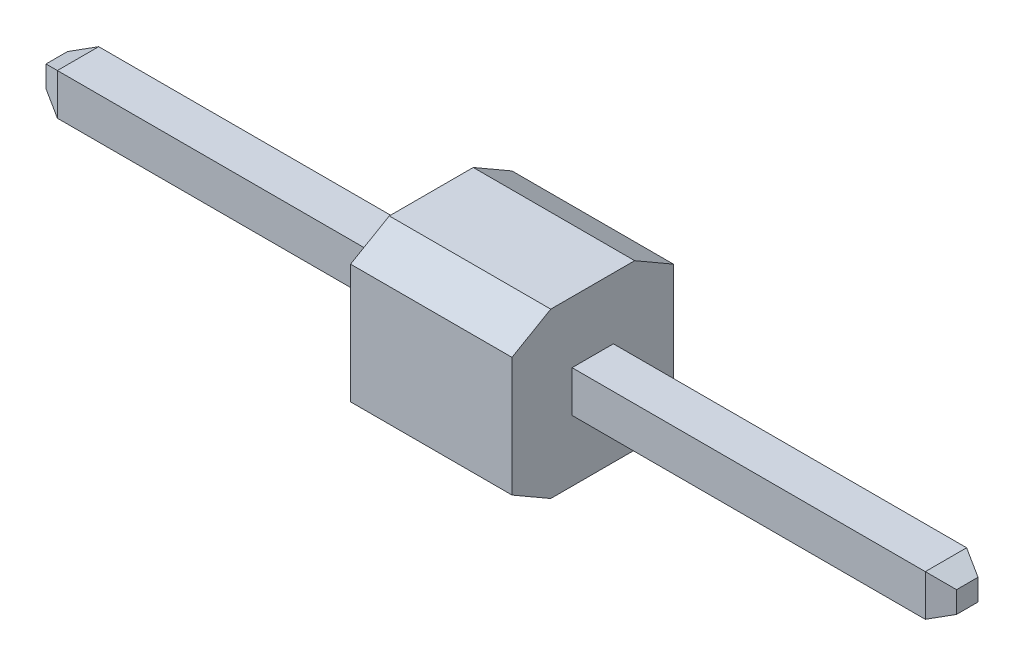
ISO-10303-21;
HEADER;
FILE_DESCRIPTION(('STEP AP214'),'2;1');
FILE_NAME('part.step','',(''),(''),'','','');
FILE_SCHEMA(('AUTOMOTIVE_DESIGN { 1 0 10303 214 1 1 1 1 }'));
ENDSEC;
DATA;
#1=APPLICATION_CONTEXT('core data for automotive mechanical design processes');
#2=APPLICATION_PROTOCOL_DEFINITION('international standard','automotive_design',2000,#1);
#3=PRODUCT_CONTEXT('',#1,'mechanical');
#4=PRODUCT('Part','Part','',(#3));
#5=PRODUCT_RELATED_PRODUCT_CATEGORY('part','',(#4));
#6=PRODUCT_DEFINITION_FORMATION('','',#4);
#7=PRODUCT_DEFINITION_CONTEXT('part definition',#1,'design');
#8=PRODUCT_DEFINITION('design','',#6,#7);
#9=PRODUCT_DEFINITION_SHAPE('','',#8);
#10=(LENGTH_UNIT() NAMED_UNIT(*) SI_UNIT(.MILLI.,.METRE.));
#11=(NAMED_UNIT(*) PLANE_ANGLE_UNIT() SI_UNIT($,.RADIAN.));
#12=(NAMED_UNIT(*) SI_UNIT($,.STERADIAN.) SOLID_ANGLE_UNIT());
#13=UNCERTAINTY_MEASURE_WITH_UNIT(LENGTH_MEASURE(1.E-05),#10,'distance_accuracy_value','');
#14=(GEOMETRIC_REPRESENTATION_CONTEXT(3) GLOBAL_UNCERTAINTY_ASSIGNED_CONTEXT((#13)) GLOBAL_UNIT_ASSIGNED_CONTEXT((#10,
#11,#12)) REPRESENTATION_CONTEXT('',''));
#15=CARTESIAN_POINT('',(0.,0.,0.));
#16=DIRECTION('',(0.,0.,1.));
#17=DIRECTION('',(1.,0.,0.));
#18=AXIS2_PLACEMENT_3D('',#15,#16,#17);
#19=CARTESIAN_POINT('',(5.42107539978359,-2.22288427394286,-2.77112037351091));
#20=DIRECTION('',(1.,-9.93476518829084E-08,4.37113882867379E-08));
#21=DIRECTION('',(-9.93476589883358E-08,-1.,8.74227765734759E-08));
#22=AXIS2_PLACEMENT_3D('',#19,#20,#21);
#23=PLANE('',#22);
#24=DIRECTION('',(-1.18186619959243E-08,-0.50000007571054,-0.866025360072933));
#25=VECTOR('',#24,1.);
#26=CARTESIAN_POINT('',(5.42107520760898,-3.46647397517509,-1.20112026479284));
#27=LINE('',#26,#25);
#28=CARTESIAN_POINT('',(5.42107520760898,-3.46647397517509,-1.20112026479284));
#29=VERTEX_POINT('',#28);
#30=CARTESIAN_POINT('',(5.42107519942078,-3.81288418914276,-1.8011202345087));
#31=VERTEX_POINT('',#30);
#32=EDGE_CURVE('E11',#29,#31,#27,.T.);
#33=ORIENTED_EDGE('',*,*,#32,.T.);
#34=DIRECTION('',(4.37113811813104E-08,-8.74227828590458E-08,-0.999999999999995));
#35=VECTOR('',#34,1.);
#36=CARTESIAN_POINT('',(5.42107519942078,-3.81288418914276,-1.8011202345087));
#37=LINE('',#36,#35);
#38=CARTESIAN_POINT('',(5.42107525624557,-3.81288430279238,-3.1011202345087));
#39=VERTEX_POINT('',#38);
#40=EDGE_CURVE('E304',#31,#39,#37,.T.);
#41=ORIENTED_EDGE('',*,*,#40,.T.);
#42=DIRECTION('',(8.75289950709518E-08,0.499999924289835,-0.866025447495714));
#43=VECTOR('',#42,1.);
#44=CARTESIAN_POINT('',(5.42107525624557,-3.81288430279238,-3.1011202345087));
#45=LINE('',#44,#43);
#46=CARTESIAN_POINT('',(5.42107531688744,-3.46647419373205,-3.70112026479284));
#47=VERTEX_POINT('',#46);
#48=EDGE_CURVE('E296',#39,#47,#45,.T.);
#49=ORIENTED_EDGE('',*,*,#48,.T.);
#50=DIRECTION('',(9.93476593246923E-08,0.999999999999991,-8.7422776482468E-08));
#51=VECTOR('',#50,1.);
#52=CARTESIAN_POINT('',(5.42107531688744,-3.46647419373205,-3.70112026479284));
#53=LINE('',#52,#51);
#54=CARTESIAN_POINT('',(5.42107550040041,-1.61929451676605,-3.70112042627841));
#55=VERTEX_POINT('',#54);
#56=EDGE_CURVE('E281',#47,#55,#53,.T.);
#57=ORIENTED_EDGE('',*,*,#56,.T.);
#58=DIRECTION('',(-1.18186619958731E-08,-0.500000075710537,-0.866025360072935));
#59=VECTOR('',#58,1.);
#60=CARTESIAN_POINT('',(5.42107550858862,-1.27288430279238,-3.10112045656255));
#61=LINE('',#60,#59);
#62=CARTESIAN_POINT('',(5.42107550858862,-1.27288430279238,-3.10112045656255));
#63=VERTEX_POINT('',#62);
#64=EDGE_CURVE('E265',#63,#55,#61,.T.);
#65=ORIENTED_EDGE('',*,*,#64,.F.);
#66=DIRECTION('',(4.37113811813104E-08,-8.74227828590458E-08,-0.999999999999995));
#67=VECTOR('',#66,1.);
#68=CARTESIAN_POINT('',(5.42107545176383,-1.27288418914276,-1.80112045656255));
#69=LINE('',#68,#67);
#70=CARTESIAN_POINT('',(5.42107545176383,-1.27288418914276,-1.80112045656255));
#71=VERTEX_POINT('',#70);
#72=EDGE_CURVE('E248',#71,#63,#69,.T.);
#73=ORIENTED_EDGE('',*,*,#72,.F.);
#74=DIRECTION('',(8.75289950705729E-08,0.499999924289834,-0.866025447495714));
#75=VECTOR('',#74,1.);
#76=CARTESIAN_POINT('',(5.42107539112196,-1.61929429820909,-1.20112042627841));
#77=LINE('',#76,#75);
#78=CARTESIAN_POINT('',(5.42107539112196,-1.61929429820909,-1.20112042627841));
#79=VERTEX_POINT('',#78);
#80=EDGE_CURVE('E242',#79,#71,#77,.T.);
#81=ORIENTED_EDGE('',*,*,#80,.F.);
#82=DIRECTION('',(9.93476593246923E-08,0.999999999999991,-8.7422776482468E-08));
#83=VECTOR('',#82,1.);
#84=CARTESIAN_POINT('',(5.42107520760898,-3.46647397517509,-1.20112026479284));
#85=LINE('',#84,#83);
#86=EDGE_CURVE('E236',#29,#79,#85,.T.);
#87=ORIENTED_EDGE('',*,*,#86,.F.);
#88=EDGE_LOOP('',(#33,#41,#49,#57,#65,#73,#81,#87));
#89=FACE_BOUND('',#88,.T.);
#90=DIRECTION('',(-4.37113803486431E-08,8.74227829017466E-08,0.999999999999995));
#91=VECTOR('',#90,1.);
#92=CARTESIAN_POINT('',(5.42107533620109,-2.86288427394286,-2.77112031756034));
#93=LINE('',#92,#91);
#94=CARTESIAN_POINT('',(5.42107533620109,-2.86288427394286,-2.77112031756034));
#95=VERTEX_POINT('',#94);
#96=CARTESIAN_POINT('',(5.42107530822581,-2.86288421799228,-2.13112031756034));
#97=VERTEX_POINT('',#96);
#98=EDGE_CURVE('E302',#95,#97,#93,.T.);
#99=ORIENTED_EDGE('',*,*,#98,.T.);
#100=DIRECTION('',(-9.93476592658906E-08,-0.999999999999991,8.74227766567418E-08));
#101=VECTOR('',#100,1.);
#102=CARTESIAN_POINT('',(5.42107537180831,-2.22288421799228,-2.13112037351091));
#103=LINE('',#102,#101);
#104=CARTESIAN_POINT('',(5.42107537180831,-2.22288421799228,-2.13112037351091));
#105=VERTEX_POINT('',#104);
#106=EDGE_CURVE('E293',#105,#97,#103,.T.);
#107=ORIENTED_EDGE('',*,*,#106,.F.);
#108=DIRECTION('',(-4.37113803486431E-08,8.74227829017466E-08,0.999999999999995));
#109=VECTOR('',#108,1.);
#110=CARTESIAN_POINT('',(5.42107539978359,-2.22288427394286,-2.77112037351091));
#111=LINE('',#110,#109);
#112=CARTESIAN_POINT('',(5.42107539978359,-2.22288427394286,-2.77112037351091));
#113=VERTEX_POINT('',#112);
#114=EDGE_CURVE('E278',#113,#105,#111,.T.);
#115=ORIENTED_EDGE('',*,*,#114,.F.);
#116=DIRECTION('',(-9.93476592658906E-08,-0.999999999999991,8.74227766567418E-08));
#117=VECTOR('',#116,1.);
#118=CARTESIAN_POINT('',(5.42107539978359,-2.22288427394286,-2.77112037351091));
#119=LINE('',#118,#117);
#120=EDGE_CURVE('E263',#113,#95,#119,.T.);
#121=ORIENTED_EDGE('',*,*,#120,.T.);
#122=EDGE_LOOP('',(#99,#107,#115,#121));
#123=FACE_BOUND('',#122,.T.);
#124=ADVANCED_FACE('F17',(#89,#123),#23,.T.);
#125=CARTESIAN_POINT('',(2.92107539978359,-2.22288402557373,-2.77112048278938));
#126=DIRECTION('',(1.,-9.93476518829084E-08,4.37113882867379E-08));
#127=DIRECTION('',(-9.93476589883358E-08,-1.,8.74227765734759E-08));
#128=AXIS2_PLACEMENT_3D('',#125,#126,#127);
#129=PLANE('',#128);
#130=DIRECTION('',(-1.18186632778994E-08,-0.50000007571054,-0.866025360072933));
#131=VECTOR('',#130,1.);
#132=CARTESIAN_POINT('',(2.92107520760898,-3.46647372680596,-1.20112037407131));
#133=LINE('',#132,#131);
#134=CARTESIAN_POINT('',(2.92107520760898,-3.46647372680596,-1.20112037407131));
#135=VERTEX_POINT('',#134);
#136=CARTESIAN_POINT('',(2.92107519942077,-3.81288394077363,-1.80112034378717));
#137=VERTEX_POINT('',#136);
#138=EDGE_CURVE('E24',#135,#137,#133,.T.);
#139=ORIENTED_EDGE('',*,*,#138,.F.);
#140=DIRECTION('',(9.93476588438628E-08,0.999999999999991,-8.7422776482468E-08));
#141=VECTOR('',#140,1.);
#142=CARTESIAN_POINT('',(2.92107520760898,-3.46647372680596,-1.20112037407131));
#143=LINE('',#142,#141);
#144=CARTESIAN_POINT('',(2.92107539112196,-1.61929404983996,-1.20112053555688));
#145=VERTEX_POINT('',#144);
#146=EDGE_CURVE('E300',#135,#145,#143,.T.);
#147=ORIENTED_EDGE('',*,*,#146,.T.);
#148=DIRECTION('',(8.7528996352548E-08,0.499999924289834,-0.866025447495714));
#149=VECTOR('',#148,1.);
#150=CARTESIAN_POINT('',(2.92107539112196,-1.61929404983996,-1.20112053555688));
#151=LINE('',#150,#149);
#152=CARTESIAN_POINT('',(2.92107545176383,-1.27288394077363,-1.80112056584102));
#153=VERTEX_POINT('',#152);
#154=EDGE_CURVE('E286',#145,#153,#151,.T.);
#155=ORIENTED_EDGE('',*,*,#154,.T.);
#156=DIRECTION('',(4.37113811813104E-08,-8.74227828590458E-08,-0.999999999999995));
#157=VECTOR('',#156,1.);
#158=CARTESIAN_POINT('',(2.92107545176383,-1.27288394077363,-1.80112056584102));
#159=LINE('',#158,#157);
#160=CARTESIAN_POINT('',(2.92107550858862,-1.27288405442325,-3.10112056584102));
#161=VERTEX_POINT('',#160);
#162=EDGE_CURVE('E271',#153,#161,#159,.T.);
#163=ORIENTED_EDGE('',*,*,#162,.T.);
#164=DIRECTION('',(-1.18186632778483E-08,-0.500000075710537,-0.866025360072935));
#165=VECTOR('',#164,1.);
#166=CARTESIAN_POINT('',(2.92107550858862,-1.27288405442325,-3.10112056584102));
#167=LINE('',#166,#165);
#168=CARTESIAN_POINT('',(2.92107550040041,-1.61929426839692,-3.70112053555688));
#169=VERTEX_POINT('',#168);
#170=EDGE_CURVE('E253',#161,#169,#167,.T.);
#171=ORIENTED_EDGE('',*,*,#170,.T.);
#172=DIRECTION('',(9.93476588438628E-08,0.999999999999991,-8.7422776482468E-08));
#173=VECTOR('',#172,1.);
#174=CARTESIAN_POINT('',(2.92107531688744,-3.46647394536292,-3.70112037407131));
#175=LINE('',#174,#173);
#176=CARTESIAN_POINT('',(2.92107531688744,-3.46647394536292,-3.70112037407131));
#177=VERTEX_POINT('',#176);
#178=EDGE_CURVE('E261',#177,#169,#175,.T.);
#179=ORIENTED_EDGE('',*,*,#178,.F.);
#180=DIRECTION('',(8.75289963529269E-08,0.499999924289835,-0.866025447495714));
#181=VECTOR('',#180,1.);
#182=CARTESIAN_POINT('',(2.92107525624557,-3.81288405442325,-3.10112034378717));
#183=LINE('',#182,#181);
#184=CARTESIAN_POINT('',(2.92107525624557,-3.81288405442325,-3.10112034378717));
#185=VERTEX_POINT('',#184);
#186=EDGE_CURVE('E276',#185,#177,#183,.T.);
#187=ORIENTED_EDGE('',*,*,#186,.F.);
#188=DIRECTION('',(4.37113811813104E-08,-8.74227828590458E-08,-0.999999999999995));
#189=VECTOR('',#188,1.);
#190=CARTESIAN_POINT('',(2.92107519942077,-3.81288394077363,-1.80112034378717));
#191=LINE('',#190,#189);
#192=EDGE_CURVE('E291',#137,#185,#191,.T.);
#193=ORIENTED_EDGE('',*,*,#192,.F.);
#194=EDGE_LOOP('',(#139,#147,#155,#163,#171,#179,#187,#193));
#195=FACE_BOUND('',#194,.T.);
#196=DIRECTION('',(-9.93476585720012E-08,-0.999999999999991,8.74227766567418E-08));
#197=VECTOR('',#196,1.);
#198=CARTESIAN_POINT('',(2.92107537180831,-2.22288396962315,-2.13112048278938));
#199=LINE('',#198,#197);
#200=CARTESIAN_POINT('',(2.92107537180831,-2.22288396962315,-2.13112048278938));
#201=VERTEX_POINT('',#200);
#202=CARTESIAN_POINT('',(2.92107530822581,-2.86288396962315,-2.13112042683881));
#203=VERTEX_POINT('',#202);
#204=EDGE_CURVE('E298',#201,#203,#199,.T.);
#205=ORIENTED_EDGE('',*,*,#204,.T.);
#206=DIRECTION('',(-4.37113810425325E-08,8.74227829017466E-08,0.999999999999995));
#207=VECTOR('',#206,1.);
#208=CARTESIAN_POINT('',(2.92107533620109,-2.86288402557373,-2.77112042683881));
#209=LINE('',#208,#207);
#210=CARTESIAN_POINT('',(2.92107533620109,-2.86288402557373,-2.77112042683881));
#211=VERTEX_POINT('',#210);
#212=EDGE_CURVE('E283',#211,#203,#209,.T.);
#213=ORIENTED_EDGE('',*,*,#212,.F.);
#214=DIRECTION('',(-9.93476585720012E-08,-0.999999999999991,8.74227766567418E-08));
#215=VECTOR('',#214,1.);
#216=CARTESIAN_POINT('',(2.92107539978359,-2.22288402557373,-2.77112048278938));
#217=LINE('',#216,#215);
#218=CARTESIAN_POINT('',(2.92107539978359,-2.22288402557373,-2.77112048278938));
#219=VERTEX_POINT('',#218);
#220=EDGE_CURVE('E268',#219,#211,#217,.T.);
#221=ORIENTED_EDGE('',*,*,#220,.F.);
#222=DIRECTION('',(-4.37113810425325E-08,8.74227829017466E-08,0.999999999999995));
#223=VECTOR('',#222,1.);
#224=CARTESIAN_POINT('',(2.92107539978359,-2.22288402557373,-2.77112048278938));
#225=LINE('',#224,#223);
#226=EDGE_CURVE('E251',#219,#201,#225,.T.);
#227=ORIENTED_EDGE('',*,*,#226,.T.);
#228=EDGE_LOOP('',(#205,#213,#221,#227));
#229=FACE_BOUND('',#228,.T.);
#230=ADVANCED_FACE('F314',(#195,#229),#129,.F.);
#231=CARTESIAN_POINT('',(5.42107520760898,-3.46647397517509,-1.20112026479284));
#232=DIRECTION('',(1.07893287081065E-07,0.866025360072937,-0.500000075710535));
#233=DIRECTION('',(1.18186629566715E-08,0.500000075710542,0.866025360072941));
#234=AXIS2_PLACEMENT_3D('',#231,#232,#233);
#235=PLANE('',#234);
#236=ORIENTED_EDGE('',*,*,#138,.T.);
#237=DIRECTION('',(-0.999999999999994,9.93476518829078E-08,-4.37113883755555E-08));
#238=VECTOR('',#237,1.);
#239=CARTESIAN_POINT('',(5.42107519942078,-3.81288418914276,-1.8011202345087));
#240=LINE('',#239,#238);
#241=EDGE_CURVE('E288',#31,#137,#240,.T.);
#242=ORIENTED_EDGE('',*,*,#241,.F.);
#243=ORIENTED_EDGE('',*,*,#32,.F.);
#244=DIRECTION('',(-0.999999999999994,9.93476525934506E-08,-4.3711388109102E-08));
#245=VECTOR('',#244,1.);
#246=CARTESIAN_POINT('',(5.42107520760898,-3.46647397517509,-1.20112026479284));
#247=LINE('',#246,#245);
#248=EDGE_CURVE('E256',#29,#135,#247,.T.);
#249=ORIENTED_EDGE('',*,*,#248,.T.);
#250=EDGE_LOOP('',(#236,#242,#243,#249));
#251=FACE_BOUND('',#250,.T.);
#252=ADVANCED_FACE('F306',(#251),#235,.F.);
#253=CARTESIAN_POINT('',(5.42107519942078,-3.81288418914276,-1.8011202345087));
#254=DIRECTION('',(9.93476589883358E-08,1.,-8.74227765734759E-08));
#255=DIRECTION('',(1.,-9.93476518829084E-08,4.37113882867379E-08));
#256=AXIS2_PLACEMENT_3D('',#253,#254,#255);
#257=PLANE('',#256);
#258=ORIENTED_EDGE('',*,*,#192,.T.);
#259=DIRECTION('',(-0.999999999999994,9.93476518829078E-08,-4.37113884643734E-08));
#260=VECTOR('',#259,1.);
#261=CARTESIAN_POINT('',(5.42107525624557,-3.81288430279238,-3.1011202345087));
#262=LINE('',#261,#260);
#263=EDGE_CURVE('E273',#39,#185,#262,.T.);
#264=ORIENTED_EDGE('',*,*,#263,.F.);
#265=ORIENTED_EDGE('',*,*,#40,.F.);
#266=ORIENTED_EDGE('',*,*,#241,.T.);
#267=EDGE_LOOP('',(#258,#264,#265,#266));
#268=FACE_BOUND('',#267,.T.);
#269=ADVANCED_FACE('F311',(#268),#257,.F.);
#270=CARTESIAN_POINT('',(5.42107525624557,-3.81288430279238,-3.1011202345087));
#271=DIRECTION('',(6.41819058997377E-08,0.866025447495721,0.499999924289845));
#272=DIRECTION('',(-8.7528996031702E-08,-0.499999924289838,0.866025447495717));
#273=AXIS2_PLACEMENT_3D('',#270,#271,#272);
#274=PLANE('',#273);
#275=ORIENTED_EDGE('',*,*,#186,.T.);
#276=DIRECTION('',(-0.999999999999994,9.93476525934506E-08,-4.37113882867377E-08));
#277=VECTOR('',#276,1.);
#278=CARTESIAN_POINT('',(5.42107531688744,-3.46647419373205,-3.70112026479284));
#279=LINE('',#278,#277);
#280=EDGE_CURVE('E258',#47,#177,#279,.T.);
#281=ORIENTED_EDGE('',*,*,#280,.F.);
#282=ORIENTED_EDGE('',*,*,#48,.F.);
#283=ORIENTED_EDGE('',*,*,#263,.T.);
#284=EDGE_LOOP('',(#275,#281,#282,#283));
#285=FACE_BOUND('',#284,.T.);
#286=ADVANCED_FACE('F319',(#285),#274,.F.);
#287=CARTESIAN_POINT('',(5.42107531688744,-3.46647419373205,-3.70112026479284));
#288=DIRECTION('',(-4.37113811813106E-08,8.74227836789032E-08,1.));
#289=DIRECTION('',(-1.,9.93476518829084E-08,-4.37113882867379E-08));
#290=AXIS2_PLACEMENT_3D('',#287,#288,#289);
#291=PLANE('',#290);
#292=ORIENTED_EDGE('',*,*,#178,.T.);
#293=DIRECTION('',(-0.999999999999994,9.93476525934505E-08,-4.37113884643734E-08));
#294=VECTOR('',#293,1.);
#295=CARTESIAN_POINT('',(5.42107550040041,-1.61929451676605,-3.70112042627841));
#296=LINE('',#295,#294);
#297=EDGE_CURVE('E245',#55,#169,#296,.T.);
#298=ORIENTED_EDGE('',*,*,#297,.F.);
#299=ORIENTED_EDGE('',*,*,#56,.F.);
#300=ORIENTED_EDGE('',*,*,#280,.T.);
#301=EDGE_LOOP('',(#292,#298,#299,#300));
#302=FACE_BOUND('',#301,.T.);
#303=ADVANCED_FACE('F326',(#302),#291,.F.);
#304=CARTESIAN_POINT('',(5.42107550858862,-1.27288430279238,-3.10112045656255));
#305=DIRECTION('',(1.07893287081065E-07,0.866025360072937,-0.500000075710535));
#306=DIRECTION('',(1.18186629566715E-08,0.500000075710542,0.866025360072941));
#307=AXIS2_PLACEMENT_3D('',#304,#305,#306);
#308=PLANE('',#307);
#309=ORIENTED_EDGE('',*,*,#170,.F.);
#310=DIRECTION('',(-0.999999999999994,9.93476518829078E-08,-4.37113882867377E-08));
#311=VECTOR('',#310,1.);
#312=CARTESIAN_POINT('',(5.42107550858862,-1.27288430279238,-3.10112045656255));
#313=LINE('',#312,#311);
#314=EDGE_CURVE('E239',#63,#161,#313,.T.);
#315=ORIENTED_EDGE('',*,*,#314,.F.);
#316=ORIENTED_EDGE('',*,*,#64,.T.);
#317=ORIENTED_EDGE('',*,*,#297,.T.);
#318=EDGE_LOOP('',(#309,#315,#316,#317));
#319=FACE_BOUND('',#318,.T.);
#320=ADVANCED_FACE('F329',(#319),#308,.T.);
#321=CARTESIAN_POINT('',(5.42107545176383,-1.27288418914276,-1.80112045656255));
#322=DIRECTION('',(9.93476589883358E-08,1.,-8.74227765734759E-08));
#323=DIRECTION('',(1.,-9.93476518829084E-08,4.37113882867379E-08));
#324=AXIS2_PLACEMENT_3D('',#321,#322,#323);
#325=PLANE('',#324);
#326=ORIENTED_EDGE('',*,*,#162,.F.);
#327=DIRECTION('',(-0.999999999999994,9.93476518829078E-08,-4.37113883755555E-08));
#328=VECTOR('',#327,1.);
#329=CARTESIAN_POINT('',(5.42107545176383,-1.27288418914276,-1.80112045656255));
#330=LINE('',#329,#328);
#331=EDGE_CURVE('E233',#71,#153,#330,.T.);
#332=ORIENTED_EDGE('',*,*,#331,.F.);
#333=ORIENTED_EDGE('',*,*,#72,.T.);
#334=ORIENTED_EDGE('',*,*,#314,.T.);
#335=EDGE_LOOP('',(#326,#332,#333,#334));
#336=FACE_BOUND('',#335,.T.);
#337=ADVANCED_FACE('F333',(#336),#325,.T.);
#338=CARTESIAN_POINT('',(5.42107539112196,-1.61929429820909,-1.20112042627841));
#339=DIRECTION('',(6.41819058997377E-08,0.866025447495721,0.499999924289845));
#340=DIRECTION('',(-8.7528996031702E-08,-0.499999924289838,0.866025447495717));
#341=AXIS2_PLACEMENT_3D('',#338,#339,#340);
#342=PLANE('',#341);
#343=ORIENTED_EDGE('',*,*,#154,.F.);
#344=DIRECTION('',(-0.999999999999994,9.93476525934505E-08,-4.3711388109102E-08));
#345=VECTOR('',#344,1.);
#346=CARTESIAN_POINT('',(5.42107539112196,-1.61929429820909,-1.20112042627841));
#347=LINE('',#346,#345);
#348=EDGE_CURVE('E230',#79,#145,#347,.T.);
#349=ORIENTED_EDGE('',*,*,#348,.F.);
#350=ORIENTED_EDGE('',*,*,#80,.T.);
#351=ORIENTED_EDGE('',*,*,#331,.T.);
#352=EDGE_LOOP('',(#343,#349,#350,#351));
#353=FACE_BOUND('',#352,.T.);
#354=ADVANCED_FACE('F337',(#353),#342,.T.);
#355=CARTESIAN_POINT('',(5.42107520760898,-3.46647397517509,-1.20112026479284));
#356=DIRECTION('',(-4.37113811813106E-08,8.74227835615132E-08,1.));
#357=DIRECTION('',(-9.93476589883358E-08,-1.,8.74227764560859E-08));
#358=AXIS2_PLACEMENT_3D('',#355,#356,#357);
#359=PLANE('',#358);
#360=ORIENTED_EDGE('',*,*,#146,.F.);
#361=ORIENTED_EDGE('',*,*,#248,.F.);
#362=ORIENTED_EDGE('',*,*,#86,.T.);
#363=ORIENTED_EDGE('',*,*,#348,.T.);
#364=EDGE_LOOP('',(#360,#361,#362,#363));
#365=FACE_BOUND('',#364,.T.);
#366=ADVANCED_FACE('F339',(#365),#359,.T.);
#367=CARTESIAN_POINT('',(-2.87892460021641,-2.22288344935735,-2.77112073631544));
#368=DIRECTION('',(-1.,9.93476518829084E-08,-4.37113882867379E-08));
#369=DIRECTION('',(9.93476589883358E-08,1.,-8.74227765734759E-08));
#370=AXIS2_PLACEMENT_3D('',#367,#368,#369);
#371=PLANE('',#370);
#372=DIRECTION('',(9.93476554747621E-08,0.999999999999991,-8.74227761417747E-08));
#373=VECTOR('',#372,1.);
#374=CARTESIAN_POINT('',(-2.87892466976005,-2.70900187966852,-2.28500222100861));
#375=LINE('',#374,#373);
#376=CARTESIAN_POINT('',(-2.87892466976005,-2.70900187966852,-2.28500222100861));
#377=VERTEX_POINT('',#376);
#378=CARTESIAN_POINT('',(-2.87892463675309,-2.37676493405952,-2.28500225005369));
#379=VERTEX_POINT('',#378);
#380=EDGE_CURVE('E228',#377,#379,#375,.T.);
#381=ORIENTED_EDGE('',*,*,#380,.T.);
#382=DIRECTION('',(4.37113820547149E-08,-8.74227801493994E-08,-0.999999999999995));
#383=VECTOR('',#382,1.);
#384=CARTESIAN_POINT('',(-2.87892463675309,-2.37676493405952,-2.28500225005369));
#385=LINE('',#384,#383);
#386=CARTESIAN_POINT('',(-2.87892462223055,-2.3767649631046,-2.61723919567169));
#387=VERTEX_POINT('',#386);
#388=EDGE_CURVE('E223',#379,#387,#385,.T.);
#389=ORIENTED_EDGE('',*,*,#388,.T.);
#390=DIRECTION('',(-9.93476608214187E-08,-0.999999999999991,8.74227774784388E-08));
#391=VECTOR('',#390,1.);
#392=CARTESIAN_POINT('',(-2.87892462223055,-2.3767649631046,-2.61723919567169));
#393=LINE('',#392,#391);
#394=CARTESIAN_POINT('',(-2.87892465523751,-2.7090019087136,-2.61723916662661));
#395=VERTEX_POINT('',#394);
#396=EDGE_CURVE('E215',#387,#395,#393,.T.);
#397=ORIENTED_EDGE('',*,*,#396,.T.);
#398=DIRECTION('',(-4.37113767080584E-08,8.74227801493995E-08,0.999999999999995));
#399=VECTOR('',#398,1.);
#400=CARTESIAN_POINT('',(-2.87892465523751,-2.7090019087136,-2.61723916662661));
#401=LINE('',#400,#399);
#402=EDGE_CURVE('E207',#395,#377,#401,.T.);
#403=ORIENTED_EDGE('',*,*,#402,.T.);
#404=EDGE_LOOP('',(#381,#389,#397,#403));
#405=FACE_BOUND('',#404,.T.);
#406=ADVANCED_FACE('F341',(#405),#371,.T.);
#407=CARTESIAN_POINT('',(-2.87892460021641,-2.22288344935735,-2.77112073631544));
#408=DIRECTION('',(9.93476589883358E-08,1.,-8.74227764510112E-08));
#409=DIRECTION('',(-4.37113811813106E-08,8.74227835564385E-08,1.));
#410=AXIS2_PLACEMENT_3D('',#407,#408,#409);
#411=PLANE('',#410);
#412=DIRECTION('',(0.999999999999994,-9.93476524284799E-08,4.37113882769953E-08));
#413=VECTOR('',#412,1.);
#414=CARTESIAN_POINT('',(-2.54892460021641,-2.22288348214208,-2.77112072189068));
#415=LINE('',#414,#413);
#416=CARTESIAN_POINT('',(-2.54892460021641,-2.22288348214208,-2.77112072189068));
#417=VERTEX_POINT('',#416);
#418=EDGE_CURVE('E225',#417,#219,#415,.T.);
#419=ORIENTED_EDGE('',*,*,#418,.F.);
#420=DIRECTION('',(-4.37113803486431E-08,8.74227829017466E-08,0.999999999999995));
#421=VECTOR('',#420,1.);
#422=CARTESIAN_POINT('',(-2.54892460021641,-2.22288348214208,-2.77112072189068));
#423=LINE('',#422,#421);
#424=CARTESIAN_POINT('',(-2.54892462819169,-2.22288342619149,-2.13112072189068));
#425=VERTEX_POINT('',#424);
#426=EDGE_CURVE('E217',#417,#425,#423,.T.);
#427=ORIENTED_EDGE('',*,*,#426,.T.);
#428=DIRECTION('',(0.999999999999994,-9.934765242848E-08,4.3711388195809E-08));
#429=VECTOR('',#428,1.);
#430=CARTESIAN_POINT('',(-2.54892462819169,-2.22288342619149,-2.13112072189068));
#431=LINE('',#430,#429);
#432=EDGE_CURVE('E220',#425,#201,#431,.T.);
#433=ORIENTED_EDGE('',*,*,#432,.T.);
#434=ORIENTED_EDGE('',*,*,#226,.F.);
#435=EDGE_LOOP('',(#419,#427,#433,#434));
#436=FACE_BOUND('',#435,.T.);
#437=ADVANCED_FACE('F348',(#436),#411,.T.);
#438=CARTESIAN_POINT('',(-2.87892462819169,-2.22288339340677,-2.13112073631544));
#439=DIRECTION('',(-4.37113811813106E-08,8.74227836789032E-08,1.));
#440=DIRECTION('',(-1.,9.93476518829084E-08,-4.37113882867379E-08));
#441=AXIS2_PLACEMENT_3D('',#438,#439,#440);
#442=PLANE('',#441);
#443=ORIENTED_EDGE('',*,*,#432,.F.);
#444=DIRECTION('',(-9.93476592658906E-08,-0.999999999999991,8.74227766567418E-08));
#445=VECTOR('',#444,1.);
#446=CARTESIAN_POINT('',(-2.54892462819169,-2.22288342619149,-2.13112072189068));
#447=LINE('',#446,#445);
#448=CARTESIAN_POINT('',(-2.54892469177419,-2.86288342619149,-2.1311206659401));
#449=VERTEX_POINT('',#448);
#450=EDGE_CURVE('E209',#425,#449,#447,.T.);
#451=ORIENTED_EDGE('',*,*,#450,.T.);
#452=DIRECTION('',(0.999999999999994,-9.93476524284799E-08,4.3711388195809E-08));
#453=VECTOR('',#452,1.);
#454=CARTESIAN_POINT('',(-2.54892469177419,-2.86288342619149,-2.1311206659401));
#455=LINE('',#454,#453);
#456=EDGE_CURVE('E212',#449,#203,#455,.T.);
#457=ORIENTED_EDGE('',*,*,#456,.T.);
#458=ORIENTED_EDGE('',*,*,#204,.F.);
#459=EDGE_LOOP('',(#443,#451,#457,#458));
#460=FACE_BOUND('',#459,.T.);
#461=ADVANCED_FACE('F424',(#460),#442,.T.);
#462=CARTESIAN_POINT('',(-2.87892466379891,-2.86288344935735,-2.77112068036486));
#463=DIRECTION('',(9.93476589883357E-08,1.,-8.74227764040693E-08));
#464=DIRECTION('',(-4.37113811813106E-08,8.74227835094966E-08,1.));
#465=AXIS2_PLACEMENT_3D('',#462,#463,#464);
#466=PLANE('',#465);
#467=ORIENTED_EDGE('',*,*,#456,.F.);
#468=DIRECTION('',(4.37113817364219E-08,-8.74227829017466E-08,-0.999999999999995));
#469=VECTOR('',#468,1.);
#470=CARTESIAN_POINT('',(-2.54892469177419,-2.86288342619149,-2.1311206659401));
#471=LINE('',#470,#469);
#472=CARTESIAN_POINT('',(-2.54892466379891,-2.86288348214208,-2.7711206659401));
#473=VERTEX_POINT('',#472);
#474=EDGE_CURVE('E201',#449,#473,#471,.T.);
#475=ORIENTED_EDGE('',*,*,#474,.T.);
#476=DIRECTION('',(0.999999999999994,-9.93476524284799E-08,4.37113882769953E-08));
#477=VECTOR('',#476,1.);
#478=CARTESIAN_POINT('',(-2.54892466379891,-2.86288348214208,-2.7711206659401));
#479=LINE('',#478,#477);
#480=EDGE_CURVE('E204',#473,#211,#479,.T.);
#481=ORIENTED_EDGE('',*,*,#480,.T.);
#482=ORIENTED_EDGE('',*,*,#212,.T.);
#483=EDGE_LOOP('',(#467,#475,#481,#482));
#484=FACE_BOUND('',#483,.T.);
#485=ADVANCED_FACE('F421',(#484),#466,.F.);
#486=CARTESIAN_POINT('',(-2.87892460021641,-2.22288344935735,-2.77112073631544));
#487=DIRECTION('',(-4.37113811813106E-08,8.74227836789032E-08,1.));
#488=DIRECTION('',(-1.,9.93476518829084E-08,-4.37113882867379E-08));
#489=AXIS2_PLACEMENT_3D('',#486,#487,#488);
#490=PLANE('',#489);
#491=ORIENTED_EDGE('',*,*,#480,.F.);
#492=DIRECTION('',(9.93476578781118E-08,0.999999999999991,-8.74227766567418E-08));
#493=VECTOR('',#492,1.);
#494=CARTESIAN_POINT('',(-2.54892466379891,-2.86288348214208,-2.7711206659401));
#495=LINE('',#494,#493);
#496=EDGE_CURVE('E196',#473,#417,#495,.T.);
#497=ORIENTED_EDGE('',*,*,#496,.T.);
#498=ORIENTED_EDGE('',*,*,#418,.T.);
#499=ORIENTED_EDGE('',*,*,#220,.T.);
#500=EDGE_LOOP('',(#491,#497,#498,#499));
#501=FACE_BOUND('',#500,.T.);
#502=ADVANCED_FACE('F376',(#501),#490,.F.);
#503=CARTESIAN_POINT('',(-2.87892460021641,-2.22288344935735,-2.77112073631544));
#504=DIRECTION('',(-4.37113811813106E-08,8.74227836789032E-08,1.));
#505=DIRECTION('',(-1.,9.93476518829084E-08,-4.37113882867379E-08));
#506=AXIS2_PLACEMENT_3D('',#503,#504,#505);
#507=PLANE('',#506);
#508=DIRECTION('',(0.999999999999994,-9.93476517789893E-08,4.37113882769953E-08));
#509=VECTOR('',#508,1.);
#510=CARTESIAN_POINT('',(5.42107539978359,-2.22288427394286,-2.77112037351091));
#511=LINE('',#510,#509);
#512=CARTESIAN_POINT('',(10.8910753997836,-2.22288481737452,-2.77112013440962));
#513=VERTEX_POINT('',#512);
#514=EDGE_CURVE('E199',#113,#513,#511,.T.);
#515=ORIENTED_EDGE('',*,*,#514,.T.);
#516=DIRECTION('',(-9.93476606536693E-08,-0.999999999999991,8.74227766567418E-08));
#517=VECTOR('',#516,1.);
#518=CARTESIAN_POINT('',(10.8910753997836,-2.22288481737452,-2.77112013440962));
#519=LINE('',#518,#517);
#520=CARTESIAN_POINT('',(10.8910753362011,-2.86288481737452,-2.77112007845904));
#521=VERTEX_POINT('',#520);
#522=EDGE_CURVE('E191',#513,#521,#519,.T.);
#523=ORIENTED_EDGE('',*,*,#522,.T.);
#524=DIRECTION('',(0.999999999999994,-9.93476517789893E-08,4.37113882769953E-08));
#525=VECTOR('',#524,1.);
#526=CARTESIAN_POINT('',(5.42107533620109,-2.86288427394286,-2.77112031756034));
#527=LINE('',#526,#525);
#528=EDGE_CURVE('E194',#95,#521,#527,.T.);
#529=ORIENTED_EDGE('',*,*,#528,.F.);
#530=ORIENTED_EDGE('',*,*,#120,.F.);
#531=EDGE_LOOP('',(#515,#523,#529,#530));
#532=FACE_BOUND('',#531,.T.);
#533=ADVANCED_FACE('F367',(#532),#507,.F.);
#534=CARTESIAN_POINT('',(-2.87892466379891,-2.86288344935735,-2.77112068036486));
#535=DIRECTION('',(9.93476589883357E-08,1.,-8.74227764040693E-08));
#536=DIRECTION('',(-4.37113811813106E-08,8.74227835094966E-08,1.));
#537=AXIS2_PLACEMENT_3D('',#534,#535,#536);
#538=PLANE('',#537);
#539=ORIENTED_EDGE('',*,*,#528,.T.);
#540=DIRECTION('',(-4.37113845119794E-08,8.74227829017466E-08,0.999999999999995));
#541=VECTOR('',#540,1.);
#542=CARTESIAN_POINT('',(10.8910753362011,-2.86288481737452,-2.77112007845904));
#543=LINE('',#542,#541);
#544=CARTESIAN_POINT('',(10.8910753082258,-2.86288476142393,-2.13112007845904));
#545=VERTEX_POINT('',#544);
#546=EDGE_CURVE('E186',#521,#545,#543,.T.);
#547=ORIENTED_EDGE('',*,*,#546,.T.);
#548=DIRECTION('',(0.999999999999994,-9.93476517789893E-08,4.37113881146227E-08));
#549=VECTOR('',#548,1.);
#550=CARTESIAN_POINT('',(5.42107530822581,-2.86288421799228,-2.13112031756034));
#551=LINE('',#550,#549);
#552=EDGE_CURVE('E189',#97,#545,#551,.T.);
#553=ORIENTED_EDGE('',*,*,#552,.F.);
#554=ORIENTED_EDGE('',*,*,#98,.F.);
#555=EDGE_LOOP('',(#539,#547,#553,#554));
#556=FACE_BOUND('',#555,.T.);
#557=ADVANCED_FACE('F364',(#556),#538,.F.);
#558=CARTESIAN_POINT('',(-2.87892462819169,-2.22288339340677,-2.13112073631544));
#559=DIRECTION('',(-4.37113811813106E-08,8.74227836789032E-08,1.));
#560=DIRECTION('',(-1.,9.93476518829084E-08,-4.37113882867379E-08));
#561=AXIS2_PLACEMENT_3D('',#558,#559,#560);
#562=PLANE('',#561);
#563=ORIENTED_EDGE('',*,*,#552,.T.);
#564=DIRECTION('',(9.93476606536693E-08,0.999999999999991,-8.74227766567418E-08));
#565=VECTOR('',#564,1.);
#566=CARTESIAN_POINT('',(10.8910753082258,-2.86288476142393,-2.13112007845904));
#567=LINE('',#566,#565);
#568=CARTESIAN_POINT('',(10.8910753718083,-2.22288476142393,-2.13112013440962));
#569=VERTEX_POINT('',#568);
#570=EDGE_CURVE('E176',#545,#569,#567,.T.);
#571=ORIENTED_EDGE('',*,*,#570,.T.);
#572=DIRECTION('',(0.999999999999994,-9.93476517789893E-08,4.37113881146227E-08));
#573=VECTOR('',#572,1.);
#574=CARTESIAN_POINT('',(5.42107537180831,-2.22288421799228,-2.13112037351091));
#575=LINE('',#574,#573);
#576=EDGE_CURVE('E179',#105,#569,#575,.T.);
#577=ORIENTED_EDGE('',*,*,#576,.F.);
#578=ORIENTED_EDGE('',*,*,#106,.T.);
#579=EDGE_LOOP('',(#563,#571,#577,#578));
#580=FACE_BOUND('',#579,.T.);
#581=ADVANCED_FACE('F366',(#580),#562,.T.);
#582=CARTESIAN_POINT('',(-2.87892460021641,-2.22288344935735,-2.77112073631544));
#583=DIRECTION('',(9.93476589883358E-08,1.,-8.74227764510112E-08));
#584=DIRECTION('',(-4.37113811813106E-08,8.74227835564385E-08,1.));
#585=AXIS2_PLACEMENT_3D('',#582,#583,#584);
#586=PLANE('',#585);
#587=ORIENTED_EDGE('',*,*,#576,.T.);
#588=DIRECTION('',(4.37113789608643E-08,-8.74227829017466E-08,-0.999999999999995));
#589=VECTOR('',#588,1.);
#590=CARTESIAN_POINT('',(10.8910753718083,-2.22288476142393,-2.13112013440962));
#591=LINE('',#590,#589);
#592=EDGE_CURVE('E167',#569,#513,#591,.T.);
#593=ORIENTED_EDGE('',*,*,#592,.T.);
#594=ORIENTED_EDGE('',*,*,#514,.F.);
#595=ORIENTED_EDGE('',*,*,#114,.T.);
#596=EDGE_LOOP('',(#587,#593,#594,#595));
#597=FACE_BOUND('',#596,.T.);
#598=ADVANCED_FACE('F373',(#597),#586,.T.);
#599=CARTESIAN_POINT('',(11.2210753997836,-2.22288485015924,-2.77112011998486));
#600=DIRECTION('',(-1.,9.93476518829084E-08,-4.37113882867379E-08));
#601=DIRECTION('',(9.93476589883358E-08,1.,-8.74227765734759E-08));
#602=AXIS2_PLACEMENT_3D('',#599,#600,#601);
#603=PLANE('',#602);
#604=DIRECTION('',(-9.93476581480904E-08,-0.999999999999991,8.74227774784388E-08));
#605=VECTOR('',#604,1.);
#606=CARTESIAN_POINT('',(11.2210753632469,-2.37676633486141,-2.28500163372311));
#607=LINE('',#606,#605);
#608=CARTESIAN_POINT('',(11.2210753632469,-2.37676633486141,-2.28500163372311));
#609=VERTEX_POINT('',#608);
#610=CARTESIAN_POINT('',(11.22107533024,-2.70900328047041,-2.28500160467804));
#611=VERTEX_POINT('',#610);
#612=EDGE_CURVE('E153',#609,#611,#607,.T.);
#613=ORIENTED_EDGE('',*,*,#612,.T.);
#614=DIRECTION('',(4.37113767080583E-08,-8.74227801493994E-08,-0.999999999999995));
#615=VECTOR('',#614,1.);
#616=CARTESIAN_POINT('',(11.22107533024,-2.70900328047041,-2.28500160467804));
#617=LINE('',#616,#615);
#618=CARTESIAN_POINT('',(11.2210753447625,-2.70900330951549,-2.61723855029604));
#619=VERTEX_POINT('',#618);
#620=EDGE_CURVE('E395',#611,#619,#617,.T.);
#621=ORIENTED_EDGE('',*,*,#620,.T.);
#622=DIRECTION('',(9.93476581480904E-08,0.999999999999991,-8.74227761417747E-08));
#623=VECTOR('',#622,1.);
#624=CARTESIAN_POINT('',(11.2210753447625,-2.70900330951549,-2.61723855029604));
#625=LINE('',#624,#623);
#626=CARTESIAN_POINT('',(11.2210753777694,-2.37676636390649,-2.61723857934111));
#627=VERTEX_POINT('',#626);
#628=EDGE_CURVE('E156',#619,#627,#625,.T.);
#629=ORIENTED_EDGE('',*,*,#628,.T.);
#630=DIRECTION('',(-4.37113820547149E-08,8.7422774802743E-08,0.999999999999995));
#631=VECTOR('',#630,1.);
#632=CARTESIAN_POINT('',(11.2210753777694,-2.37676636390649,-2.61723857934111));
#633=LINE('',#632,#631);
#634=EDGE_CURVE('E149',#627,#609,#633,.T.);
#635=ORIENTED_EDGE('',*,*,#634,.T.);
#636=EDGE_LOOP('',(#613,#621,#629,#635));
#637=FACE_BOUND('',#636,.T.);
#638=ADVANCED_FACE('F151',(#637),#603,.F.);
#639=CARTESIAN_POINT('',(-2.87892464851114,-2.70900192216635,-2.77112069381761));
#640=DIRECTION('',(-0.422618351780369,-0.906307745050466,6.07587120833484E-08));
#641=DIRECTION('',(4.37113811813106E-08,-8.74227835094966E-08,-1.));
#642=AXIS2_PLACEMENT_3D('',#639,#640,#641);
#643=PLANE('',#642);
#644=DIRECTION('',(0.83481707378875,-0.389281669540042,0.389281691158096));
#645=VECTOR('',#644,1.);
#646=CARTESIAN_POINT('',(-2.87892466975974,-2.70900187966819,-2.28500222100894));
#647=LINE('',#646,#645);
#648=EDGE_CURVE('E181',#377,#449,#647,.T.);
#649=ORIENTED_EDGE('',*,*,#648,.F.);
#650=ORIENTED_EDGE('',*,*,#402,.F.);
#651=DIRECTION('',(-0.83481710782082,0.38928173760421,0.389281550111905));
#652=VECTOR('',#651,1.);
#653=CARTESIAN_POINT('',(-2.54892466379869,-2.86288348214184,-2.77112066593987));
#654=LINE('',#653,#652);
#655=EDGE_CURVE('E404',#473,#395,#654,.T.);
#656=ORIENTED_EDGE('',*,*,#655,.F.);
#657=ORIENTED_EDGE('',*,*,#474,.F.);
#658=EDGE_LOOP('',(#649,#650,#656,#657));
#659=FACE_BOUND('',#658,.T.);
#660=ADVANCED_FACE('F418',(#659),#643,.T.);
#661=CARTESIAN_POINT('',(-2.87892460694278,-2.2228834359046,-2.61723920912444));
#662=DIRECTION('',(-0.422618222124847,-3.72458176658199E-08,-0.906307805509828));
#663=DIRECTION('',(9.93476589883358E-08,1.,-8.74227765734759E-08));
#664=AXIS2_PLACEMENT_3D('',#661,#662,#663);
#665=PLANE('',#664);
#666=ORIENTED_EDGE('',*,*,#655,.T.);
#667=ORIENTED_EDGE('',*,*,#396,.F.);
#668=DIRECTION('',(-0.834817185169259,-0.389281503665791,0.389281618176066));
#669=VECTOR('',#668,1.);
#670=CARTESIAN_POINT('',(-2.54892460021526,-2.22288348214481,-2.77112072189095));
#671=LINE('',#670,#669);
#672=EDGE_CURVE('E160',#417,#387,#671,.T.);
#673=ORIENTED_EDGE('',*,*,#672,.F.);
#674=ORIENTED_EDGE('',*,*,#496,.F.);
#675=EDGE_LOOP('',(#666,#667,#673,#674));
#676=FACE_BOUND('',#675,.T.);
#677=ADVANCED_FACE('F434',(#676),#665,.T.);
#678=CARTESIAN_POINT('',(-2.54892462819169,-2.22288342619149,-2.13112072189068));
#679=DIRECTION('',(0.422618301356777,-1.21218081559392E-07,-0.906307768563367));
#680=DIRECTION('',(-9.93476589883358E-08,-1.,8.74227765734759E-08));
#681=AXIS2_PLACEMENT_3D('',#678,#679,#680);
#682=PLANE('',#681);
#683=ORIENTED_EDGE('',*,*,#648,.T.);
#684=ORIENTED_EDGE('',*,*,#450,.F.);
#685=DIRECTION('',(0.834817151137183,0.389281571729962,0.389281623093935));
#686=VECTOR('',#685,1.);
#687=CARTESIAN_POINT('',(-2.87892463675592,-2.37676493405198,-2.28500225005515));
#688=LINE('',#687,#686);
#689=EDGE_CURVE('E170',#379,#425,#688,.T.);
#690=ORIENTED_EDGE('',*,*,#689,.F.);
#691=ORIENTED_EDGE('',*,*,#380,.F.);
#692=EDGE_LOOP('',(#683,#684,#690,#691));
#693=FACE_BOUND('',#692,.T.);
#694=ADVANCED_FACE('F413',(#693),#682,.F.);
#695=CARTESIAN_POINT('',(-2.54892460021641,-2.22288348214208,-2.77112072189068));
#696=DIRECTION('',(0.422618171701255,-0.906307829022729,9.770517399793E-08));
#697=DIRECTION('',(-4.37113811813106E-08,8.74227835564385E-08,1.));
#698=AXIS2_PLACEMENT_3D('',#695,#696,#697);
#699=PLANE('',#698);
#700=ORIENTED_EDGE('',*,*,#672,.T.);
#701=ORIENTED_EDGE('',*,*,#388,.F.);
#702=ORIENTED_EDGE('',*,*,#689,.T.);
#703=ORIENTED_EDGE('',*,*,#426,.F.);
#704=EDGE_LOOP('',(#700,#701,#702,#703));
#705=FACE_BOUND('',#704,.T.);
#706=ADVANCED_FACE('F429',(#705),#699,.F.);
#707=CARTESIAN_POINT('',(11.2210753844958,-2.37676637735924,-2.77112010653211));
#708=DIRECTION('',(0.422618351780369,0.906307745050466,-6.07587121258922E-08));
#709=DIRECTION('',(4.37113811813106E-08,-8.74227835564385E-08,-1.));
#710=AXIS2_PLACEMENT_3D('',#707,#708,#709);
#711=PLANE('',#710);
#712=DIRECTION('',(-0.83481710782082,0.38928173760421,0.389281550111905));
#713=VECTOR('',#712,1.);
#714=CARTESIAN_POINT('',(11.2210753632495,-2.37676633485411,-2.28500163372481));
#715=LINE('',#714,#713);
#716=EDGE_CURVE('E164',#609,#569,#715,.T.);
#717=ORIENTED_EDGE('',*,*,#716,.F.);
#718=ORIENTED_EDGE('',*,*,#634,.F.);
#719=DIRECTION('',(0.834817073788748,-0.389281669540044,0.389281691158098));
#720=VECTOR('',#719,1.);
#721=CARTESIAN_POINT('',(10.8910753997836,-2.22288481737452,-2.77112013440962));
#722=LINE('',#721,#720);
#723=EDGE_CURVE('E392',#513,#627,#722,.T.);
#724=ORIENTED_EDGE('',*,*,#723,.F.);
#725=ORIENTED_EDGE('',*,*,#592,.F.);
#726=EDGE_LOOP('',(#717,#718,#724,#725));
#727=FACE_BOUND('',#726,.T.);
#728=ADVANCED_FACE('F165',(#727),#711,.T.);
#729=CARTESIAN_POINT('',(10.8910753997836,-2.22288481737452,-2.77112013440962));
#730=DIRECTION('',(-0.422618301356777,1.21218081559392E-07,0.906307768563367));
#731=DIRECTION('',(-9.93476589883358E-08,-1.,8.74227765734759E-08));
#732=AXIS2_PLACEMENT_3D('',#729,#730,#731);
#733=PLANE('',#732);
#734=ORIENTED_EDGE('',*,*,#723,.T.);
#735=ORIENTED_EDGE('',*,*,#628,.F.);
#736=DIRECTION('',(0.834817151137181,0.389281571729963,0.389281623093939));
#737=VECTOR('',#736,1.);
#738=CARTESIAN_POINT('',(10.891075336201,-2.86288481737448,-2.7711200784589));
#739=LINE('',#738,#737);
#740=EDGE_CURVE('E389',#521,#619,#739,.T.);
#741=ORIENTED_EDGE('',*,*,#740,.F.);
#742=ORIENTED_EDGE('',*,*,#522,.F.);
#743=EDGE_LOOP('',(#734,#735,#741,#742));
#744=FACE_BOUND('',#743,.T.);
#745=ADVANCED_FACE('F390',(#744),#733,.F.);
#746=CARTESIAN_POINT('',(11.2210753785347,-2.22288480766141,-2.28500164717586));
#747=DIRECTION('',(0.422618222124847,3.72458176658199E-08,0.906307805509828));
#748=DIRECTION('',(9.93476589883358E-08,1.,-8.74227765734759E-08));
#749=AXIS2_PLACEMENT_3D('',#746,#747,#748);
#750=PLANE('',#749);
#751=ORIENTED_EDGE('',*,*,#716,.T.);
#752=ORIENTED_EDGE('',*,*,#570,.F.);
#753=DIRECTION('',(-0.834817185169259,-0.389281503665793,0.389281618176064));
#754=VECTOR('',#753,1.);
#755=CARTESIAN_POINT('',(11.2210753302396,-2.70900328047008,-2.28500160467837));
#756=LINE('',#755,#754);
#757=EDGE_CURVE('E175',#611,#545,#756,.T.);
#758=ORIENTED_EDGE('',*,*,#757,.F.);
#759=ORIENTED_EDGE('',*,*,#612,.F.);
#760=EDGE_LOOP('',(#751,#752,#758,#759));
#761=FACE_BOUND('',#760,.T.);
#762=ADVANCED_FACE('F173',(#761),#750,.T.);
#763=CARTESIAN_POINT('',(10.8910753362011,-2.86288481737452,-2.77112007845904));
#764=DIRECTION('',(-0.422618171701255,0.906307829022729,-9.77051739553862E-08));
#765=DIRECTION('',(-4.37113811813106E-08,8.74227835094966E-08,1.));
#766=AXIS2_PLACEMENT_3D('',#763,#764,#765);
#767=PLANE('',#766);
#768=ORIENTED_EDGE('',*,*,#740,.T.);
#769=ORIENTED_EDGE('',*,*,#620,.F.);
#770=ORIENTED_EDGE('',*,*,#757,.T.);
#771=ORIENTED_EDGE('',*,*,#546,.F.);
#772=EDGE_LOOP('',(#768,#769,#770,#771));
#773=FACE_BOUND('',#772,.T.);
#774=ADVANCED_FACE('F394',(#773),#767,.F.);
#775=CLOSED_SHELL('',(#124,#230,#252,#269,#286,#303,#320,#337,#354,#366,#406,#437,#461,#485,
#502,#533,#557,#581,#598,#638,#660,#677,#694,#706,#728,#745,#762,#774));
#776=MANIFOLD_SOLID_BREP('B1',#775);
#777=ADVANCED_BREP_SHAPE_REPRESENTATION('',(#18,#776),#14);
#778=SHAPE_DEFINITION_REPRESENTATION(#9,#777);
ENDSEC;
END-ISO-10303-21;
